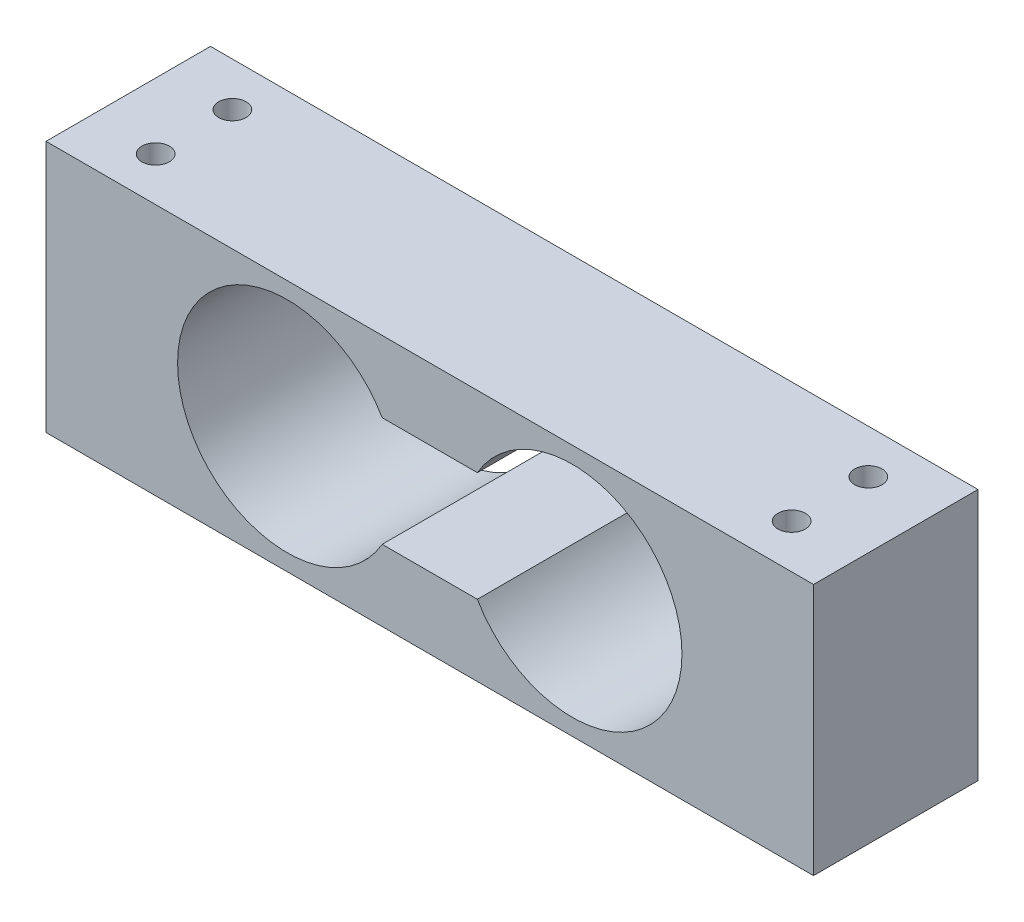
ISO-10303-21;
HEADER;
FILE_DESCRIPTION(('STEP AP214'),'2;1');
FILE_NAME('part.step','',(''),(''),'','','');
FILE_SCHEMA(('AUTOMOTIVE_DESIGN { 1 0 10303 214 1 1 1 1 }'));
ENDSEC;
DATA;
#1=APPLICATION_CONTEXT('core data for automotive mechanical design processes');
#2=APPLICATION_PROTOCOL_DEFINITION('international standard','automotive_design',2000,#1);
#3=PRODUCT_CONTEXT('',#1,'mechanical');
#4=PRODUCT('Part','Part','',(#3));
#5=PRODUCT_RELATED_PRODUCT_CATEGORY('part','',(#4));
#6=PRODUCT_DEFINITION_FORMATION('','',#4);
#7=PRODUCT_DEFINITION_CONTEXT('part definition',#1,'design');
#8=PRODUCT_DEFINITION('design','',#6,#7);
#9=PRODUCT_DEFINITION_SHAPE('','',#8);
#10=(LENGTH_UNIT() NAMED_UNIT(*) SI_UNIT(.MILLI.,.METRE.));
#11=(NAMED_UNIT(*) PLANE_ANGLE_UNIT() SI_UNIT($,.RADIAN.));
#12=(NAMED_UNIT(*) SI_UNIT($,.STERADIAN.) SOLID_ANGLE_UNIT());
#13=UNCERTAINTY_MEASURE_WITH_UNIT(LENGTH_MEASURE(1.E-05),#10,'distance_accuracy_value','');
#14=(GEOMETRIC_REPRESENTATION_CONTEXT(3) GLOBAL_UNCERTAINTY_ASSIGNED_CONTEXT((#13)) GLOBAL_UNIT_ASSIGNED_CONTEXT((#10,
#11,#12)) REPRESENTATION_CONTEXT('',''));
#15=CARTESIAN_POINT('',(0.,0.,0.));
#16=DIRECTION('',(0.,0.,1.));
#17=DIRECTION('',(1.,0.,0.));
#18=AXIS2_PLACEMENT_3D('',#15,#16,#17);
#19=CARTESIAN_POINT('',(0.,23.,7.5));
#20=DIRECTION('',(0.,0.,1.));
#21=DIRECTION('',(1.,0.,0.));
#22=AXIS2_PLACEMENT_3D('',#19,#20,#21);
#23=PLANE('',#22);
#24=DIRECTION('',(0.,1.,0.));
#25=VECTOR('',#24,1.);
#26=CARTESIAN_POINT('',(0.,0.,7.5));
#27=LINE('',#26,#25);
#28=CARTESIAN_POINT('',(0.,0.,7.5));
#29=VERTEX_POINT('',#28);
#30=CARTESIAN_POINT('',(0.,23.,7.5));
#31=VERTEX_POINT('',#30);
#32=EDGE_CURVE('E140',#29,#31,#27,.T.);
#33=ORIENTED_EDGE('',*,*,#32,.T.);
#34=DIRECTION('',(-1.,0.,0.));
#35=VECTOR('',#34,1.);
#36=CARTESIAN_POINT('',(0.,23.,7.5));
#37=LINE('',#36,#35);
#38=CARTESIAN_POINT('',(-70.,23.,7.5));
#39=VERTEX_POINT('',#38);
#40=EDGE_CURVE('E143',#31,#39,#37,.T.);
#41=ORIENTED_EDGE('',*,*,#40,.T.);
#42=DIRECTION('',(0.,-1.,0.));
#43=VECTOR('',#42,1.);
#44=CARTESIAN_POINT('',(-70.,0.,7.5));
#45=LINE('',#44,#43);
#46=CARTESIAN_POINT('',(-70.,0.,7.5));
#47=VERTEX_POINT('',#46);
#48=EDGE_CURVE('E145',#39,#47,#45,.T.);
#49=ORIENTED_EDGE('',*,*,#48,.T.);
#50=DIRECTION('',(1.,0.,0.));
#51=VECTOR('',#50,1.);
#52=CARTESIAN_POINT('',(0.,0.,7.5));
#53=LINE('',#52,#51);
#54=EDGE_CURVE('E147',#47,#29,#53,.T.);
#55=ORIENTED_EDGE('',*,*,#54,.T.);
#56=EDGE_LOOP('',(#33,#41,#49,#55));
#57=FACE_BOUND('',#56,.T.);
#58=DIRECTION('',(1.,0.,0.));
#59=VECTOR('',#58,1.);
#60=CARTESIAN_POINT('',(-39.3397459621556,6.5,7.5));
#61=LINE('',#60,#59);
#62=CARTESIAN_POINT('',(-39.3397459621556,6.5,7.5));
#63=VERTEX_POINT('',#62);
#64=CARTESIAN_POINT('',(-30.6602540378444,6.5,7.5));
#65=VERTEX_POINT('',#64);
#66=EDGE_CURVE('E122',#63,#65,#61,.T.);
#67=ORIENTED_EDGE('',*,*,#66,.F.);
#68=CARTESIAN_POINT('',(-48.,11.5,7.5));
#69=DIRECTION('',(0.,0.,1.));
#70=DIRECTION('',(1.,0.,0.));
#71=AXIS2_PLACEMENT_3D('',#68,#69,#70);
#72=CIRCLE('',#71,10.);
#73=CARTESIAN_POINT('',(-39.3397459621556,16.5,7.5));
#74=VERTEX_POINT('',#73);
#75=EDGE_CURVE('E106',#74,#63,#72,.T.);
#76=ORIENTED_EDGE('',*,*,#75,.F.);
#77=DIRECTION('',(-1.,0.,0.));
#78=VECTOR('',#77,1.);
#79=CARTESIAN_POINT('',(-39.3397459621556,16.5,7.5));
#80=LINE('',#79,#78);
#81=CARTESIAN_POINT('',(-30.6602540378444,16.5,7.5));
#82=VERTEX_POINT('',#81);
#83=EDGE_CURVE('E126',#82,#74,#80,.T.);
#84=ORIENTED_EDGE('',*,*,#83,.F.);
#85=CARTESIAN_POINT('',(-22.,11.5,7.5));
#86=DIRECTION('',(0.,0.,1.));
#87=DIRECTION('',(1.,0.,0.));
#88=AXIS2_PLACEMENT_3D('',#85,#86,#87);
#89=CIRCLE('',#88,10.);
#90=EDGE_CURVE('E124',#65,#82,#89,.T.);
#91=ORIENTED_EDGE('',*,*,#90,.F.);
#92=EDGE_LOOP('',(#67,#76,#84,#91));
#93=FACE_BOUND('',#92,.T.);
#94=ADVANCED_FACE('F26',(#57,#93),#23,.T.);
#95=CARTESIAN_POINT('',(0.,23.,-7.5));
#96=DIRECTION('',(0.,0.,1.));
#97=DIRECTION('',(1.,0.,0.));
#98=AXIS2_PLACEMENT_3D('',#95,#96,#97);
#99=PLANE('',#98);
#100=DIRECTION('',(0.,1.,0.));
#101=VECTOR('',#100,1.);
#102=CARTESIAN_POINT('',(0.,0.,-7.5));
#103=LINE('',#102,#101);
#104=CARTESIAN_POINT('',(0.,0.,-7.5));
#105=VERTEX_POINT('',#104);
#106=CARTESIAN_POINT('',(0.,23.,-7.5));
#107=VERTEX_POINT('',#106);
#108=EDGE_CURVE('E107',#105,#107,#103,.T.);
#109=ORIENTED_EDGE('',*,*,#108,.F.);
#110=DIRECTION('',(1.,0.,0.));
#111=VECTOR('',#110,1.);
#112=CARTESIAN_POINT('',(0.,0.,-7.5));
#113=LINE('',#112,#111);
#114=CARTESIAN_POINT('',(-70.,0.,-7.5));
#115=VERTEX_POINT('',#114);
#116=EDGE_CURVE('E138',#115,#105,#113,.T.);
#117=ORIENTED_EDGE('',*,*,#116,.F.);
#118=DIRECTION('',(0.,-1.,0.));
#119=VECTOR('',#118,1.);
#120=CARTESIAN_POINT('',(-70.,0.,-7.5));
#121=LINE('',#120,#119);
#122=CARTESIAN_POINT('',(-70.,23.,-7.5));
#123=VERTEX_POINT('',#122);
#124=EDGE_CURVE('E136',#123,#115,#121,.T.);
#125=ORIENTED_EDGE('',*,*,#124,.F.);
#126=DIRECTION('',(-1.,0.,0.));
#127=VECTOR('',#126,1.);
#128=CARTESIAN_POINT('',(0.,23.,-7.5));
#129=LINE('',#128,#127);
#130=EDGE_CURVE('E134',#107,#123,#129,.T.);
#131=ORIENTED_EDGE('',*,*,#130,.F.);
#132=EDGE_LOOP('',(#109,#117,#125,#131));
#133=FACE_BOUND('',#132,.T.);
#134=CARTESIAN_POINT('',(-48.,11.5,-7.5));
#135=DIRECTION('',(0.,0.,1.));
#136=DIRECTION('',(1.,0.,0.));
#137=AXIS2_PLACEMENT_3D('',#134,#135,#136);
#138=CIRCLE('',#137,10.);
#139=CARTESIAN_POINT('',(-39.3397459621556,16.5,-7.5));
#140=VERTEX_POINT('',#139);
#141=CARTESIAN_POINT('',(-39.3397459621556,6.5,-7.5));
#142=VERTEX_POINT('',#141);
#143=EDGE_CURVE('E49',#140,#142,#138,.T.);
#144=ORIENTED_EDGE('',*,*,#143,.T.);
#145=DIRECTION('',(1.,0.,0.));
#146=VECTOR('',#145,1.);
#147=CARTESIAN_POINT('',(-39.3397459621556,6.5,-7.5));
#148=LINE('',#147,#146);
#149=CARTESIAN_POINT('',(-30.6602540378444,6.5,-7.5));
#150=VERTEX_POINT('',#149);
#151=EDGE_CURVE('E93',#142,#150,#148,.T.);
#152=ORIENTED_EDGE('',*,*,#151,.T.);
#153=CARTESIAN_POINT('',(-22.,11.5,-7.5));
#154=DIRECTION('',(0.,0.,1.));
#155=DIRECTION('',(1.,0.,0.));
#156=AXIS2_PLACEMENT_3D('',#153,#154,#155);
#157=CIRCLE('',#156,10.);
#158=CARTESIAN_POINT('',(-30.6602540378444,16.5,-7.5));
#159=VERTEX_POINT('',#158);
#160=EDGE_CURVE('E102',#150,#159,#157,.T.);
#161=ORIENTED_EDGE('',*,*,#160,.T.);
#162=DIRECTION('',(-1.,0.,0.));
#163=VECTOR('',#162,1.);
#164=CARTESIAN_POINT('',(-39.3397459621556,16.5,-7.5));
#165=LINE('',#164,#163);
#166=EDGE_CURVE('E111',#159,#140,#165,.T.);
#167=ORIENTED_EDGE('',*,*,#166,.T.);
#168=EDGE_LOOP('',(#144,#152,#161,#167));
#169=FACE_BOUND('',#168,.T.);
#170=ADVANCED_FACE('F110',(#133,#169),#99,.F.);
#171=CARTESIAN_POINT('',(0.,0.,7.5));
#172=DIRECTION('',(-1.,0.,0.));
#173=DIRECTION('',(0.,0.,1.));
#174=AXIS2_PLACEMENT_3D('',#171,#172,#173);
#175=PLANE('',#174);
#176=ORIENTED_EDGE('',*,*,#108,.T.);
#177=DIRECTION('',(0.,0.,-1.));
#178=VECTOR('',#177,1.);
#179=CARTESIAN_POINT('',(0.,23.,7.5));
#180=LINE('',#179,#178);
#181=EDGE_CURVE('E11',#31,#107,#180,.T.);
#182=ORIENTED_EDGE('',*,*,#181,.F.);
#183=ORIENTED_EDGE('',*,*,#32,.F.);
#184=DIRECTION('',(0.,0.,-1.));
#185=VECTOR('',#184,1.);
#186=CARTESIAN_POINT('',(0.,0.,7.5));
#187=LINE('',#186,#185);
#188=EDGE_CURVE('E149',#29,#105,#187,.T.);
#189=ORIENTED_EDGE('',*,*,#188,.T.);
#190=EDGE_LOOP('',(#176,#182,#183,#189));
#191=FACE_BOUND('',#190,.T.);
#192=ADVANCED_FACE('F28',(#191),#175,.F.);
#193=CARTESIAN_POINT('',(0.,23.,7.5));
#194=DIRECTION('',(0.,-1.,0.));
#195=DIRECTION('',(1.,0.,0.));
#196=AXIS2_PLACEMENT_3D('',#193,#194,#195);
#197=PLANE('',#196);
#198=CARTESIAN_POINT('',(-64.,23.,-3.5));
#199=DIRECTION('',(0.,1.,0.));
#200=DIRECTION('',(0.,0.,1.));
#201=AXIS2_PLACEMENT_3D('',#198,#199,#200);
#202=CIRCLE('',#201,1.25);
#203=CARTESIAN_POINT('',(-64.,23.,-2.25));
#204=VERTEX_POINT('',#203);
#205=EDGE_CURVE('E223',#204,#204,#202,.T.);
#206=ORIENTED_EDGE('',*,*,#205,.F.);
#207=EDGE_LOOP('',(#206));
#208=FACE_BOUND('',#207,.T.);
#209=CARTESIAN_POINT('',(-64.,23.,3.5));
#210=DIRECTION('',(0.,1.,0.));
#211=DIRECTION('',(0.,0.,1.));
#212=AXIS2_PLACEMENT_3D('',#209,#210,#211);
#213=CIRCLE('',#212,1.25);
#214=CARTESIAN_POINT('',(-64.,23.,4.75));
#215=VERTEX_POINT('',#214);
#216=EDGE_CURVE('E219',#215,#215,#213,.T.);
#217=ORIENTED_EDGE('',*,*,#216,.F.);
#218=EDGE_LOOP('',(#217));
#219=FACE_BOUND('',#218,.T.);
#220=CARTESIAN_POINT('',(-6.,23.,-3.5));
#221=DIRECTION('',(0.,1.,0.));
#222=DIRECTION('',(0.,0.,1.));
#223=AXIS2_PLACEMENT_3D('',#220,#221,#222);
#224=CIRCLE('',#223,1.25);
#225=CARTESIAN_POINT('',(-6.,23.,-2.25));
#226=VERTEX_POINT('',#225);
#227=EDGE_CURVE('E214',#226,#226,#224,.T.);
#228=ORIENTED_EDGE('',*,*,#227,.F.);
#229=EDGE_LOOP('',(#228));
#230=FACE_BOUND('',#229,.T.);
#231=CARTESIAN_POINT('',(-6.,23.,3.50000000000001));
#232=DIRECTION('',(0.,1.,0.));
#233=DIRECTION('',(0.,0.,1.));
#234=AXIS2_PLACEMENT_3D('',#231,#232,#233);
#235=CIRCLE('',#234,1.25);
#236=CARTESIAN_POINT('',(-6.,23.,4.75000000000001));
#237=VERTEX_POINT('',#236);
#238=EDGE_CURVE('E112',#237,#237,#235,.T.);
#239=ORIENTED_EDGE('',*,*,#238,.F.);
#240=EDGE_LOOP('',(#239));
#241=FACE_BOUND('',#240,.T.);
#242=ORIENTED_EDGE('',*,*,#130,.T.);
#243=DIRECTION('',(0.,0.,-1.));
#244=VECTOR('',#243,1.);
#245=CARTESIAN_POINT('',(-70.,23.,7.5));
#246=LINE('',#245,#244);
#247=EDGE_CURVE('E34',#39,#123,#246,.T.);
#248=ORIENTED_EDGE('',*,*,#247,.F.);
#249=ORIENTED_EDGE('',*,*,#40,.F.);
#250=ORIENTED_EDGE('',*,*,#181,.T.);
#251=EDGE_LOOP('',(#242,#248,#249,#250));
#252=FACE_BOUND('',#251,.T.);
#253=ADVANCED_FACE('F174',(#208,#219,#230,#241,#252),#197,.F.);
#254=CARTESIAN_POINT('',(-70.,0.,7.5));
#255=DIRECTION('',(1.,0.,0.));
#256=DIRECTION('',(0.,0.,-1.));
#257=AXIS2_PLACEMENT_3D('',#254,#255,#256);
#258=PLANE('',#257);
#259=ORIENTED_EDGE('',*,*,#124,.T.);
#260=DIRECTION('',(0.,0.,-1.));
#261=VECTOR('',#260,1.);
#262=CARTESIAN_POINT('',(-70.,0.,7.5));
#263=LINE('',#262,#261);
#264=EDGE_CURVE('E152',#47,#115,#263,.T.);
#265=ORIENTED_EDGE('',*,*,#264,.F.);
#266=ORIENTED_EDGE('',*,*,#48,.F.);
#267=ORIENTED_EDGE('',*,*,#247,.T.);
#268=EDGE_LOOP('',(#259,#265,#266,#267));
#269=FACE_BOUND('',#268,.T.);
#270=ADVANCED_FACE('F159',(#269),#258,.F.);
#271=CARTESIAN_POINT('',(0.,0.,7.5));
#272=DIRECTION('',(0.,1.,0.));
#273=DIRECTION('',(-1.,0.,0.));
#274=AXIS2_PLACEMENT_3D('',#271,#272,#273);
#275=PLANE('',#274);
#276=CARTESIAN_POINT('',(-64.,0.,-3.5));
#277=DIRECTION('',(0.,1.,0.));
#278=DIRECTION('',(0.,0.,1.));
#279=AXIS2_PLACEMENT_3D('',#276,#277,#278);
#280=CIRCLE('',#279,1.25);
#281=CARTESIAN_POINT('',(-64.,0.,-2.25));
#282=VERTEX_POINT('',#281);
#283=EDGE_CURVE('E202',#282,#282,#280,.T.);
#284=ORIENTED_EDGE('',*,*,#283,.T.);
#285=EDGE_LOOP('',(#284));
#286=FACE_BOUND('',#285,.T.);
#287=CARTESIAN_POINT('',(-64.,0.,3.5));
#288=DIRECTION('',(0.,1.,0.));
#289=DIRECTION('',(0.,0.,1.));
#290=AXIS2_PLACEMENT_3D('',#287,#288,#289);
#291=CIRCLE('',#290,1.25);
#292=CARTESIAN_POINT('',(-64.,0.,4.75));
#293=VERTEX_POINT('',#292);
#294=EDGE_CURVE('E206',#293,#293,#291,.T.);
#295=ORIENTED_EDGE('',*,*,#294,.T.);
#296=EDGE_LOOP('',(#295));
#297=FACE_BOUND('',#296,.T.);
#298=CARTESIAN_POINT('',(-6.,0.,-3.5));
#299=DIRECTION('',(0.,1.,0.));
#300=DIRECTION('',(0.,0.,1.));
#301=AXIS2_PLACEMENT_3D('',#298,#299,#300);
#302=CIRCLE('',#301,1.24999999999999);
#303=CARTESIAN_POINT('',(-6.,0.,-2.25000000000001));
#304=VERTEX_POINT('',#303);
#305=EDGE_CURVE('E210',#304,#304,#302,.T.);
#306=ORIENTED_EDGE('',*,*,#305,.T.);
#307=EDGE_LOOP('',(#306));
#308=FACE_BOUND('',#307,.T.);
#309=CARTESIAN_POINT('',(-6.,0.,3.50000000000001));
#310=DIRECTION('',(0.,1.,0.));
#311=DIRECTION('',(0.,0.,1.));
#312=AXIS2_PLACEMENT_3D('',#309,#310,#311);
#313=CIRCLE('',#312,1.24999999999999);
#314=CARTESIAN_POINT('',(-6.,0.,4.75));
#315=VERTEX_POINT('',#314);
#316=EDGE_CURVE('E115',#315,#315,#313,.T.);
#317=ORIENTED_EDGE('',*,*,#316,.T.);
#318=EDGE_LOOP('',(#317));
#319=FACE_BOUND('',#318,.T.);
#320=ORIENTED_EDGE('',*,*,#116,.T.);
#321=ORIENTED_EDGE('',*,*,#188,.F.);
#322=ORIENTED_EDGE('',*,*,#54,.F.);
#323=ORIENTED_EDGE('',*,*,#264,.T.);
#324=EDGE_LOOP('',(#320,#321,#322,#323));
#325=FACE_BOUND('',#324,.T.);
#326=ADVANCED_FACE('F167',(#286,#297,#308,#319,#325),#275,.F.);
#327=CARTESIAN_POINT('',(-48.,11.5,7.5));
#328=DIRECTION('',(0.,0.,-1.));
#329=DIRECTION('',(-1.,0.,0.));
#330=AXIS2_PLACEMENT_3D('',#327,#328,#329);
#331=CYLINDRICAL_SURFACE('',#330,10.);
#332=ORIENTED_EDGE('',*,*,#143,.F.);
#333=DIRECTION('',(0.,0.,-1.));
#334=VECTOR('',#333,1.);
#335=CARTESIAN_POINT('',(-39.3397459621556,16.5,7.5));
#336=LINE('',#335,#334);
#337=EDGE_CURVE('E128',#74,#140,#336,.T.);
#338=ORIENTED_EDGE('',*,*,#337,.F.);
#339=ORIENTED_EDGE('',*,*,#75,.T.);
#340=DIRECTION('',(0.,0.,-1.));
#341=VECTOR('',#340,1.);
#342=CARTESIAN_POINT('',(-39.3397459621556,6.5,7.5));
#343=LINE('',#342,#341);
#344=EDGE_CURVE('E95',#63,#142,#343,.T.);
#345=ORIENTED_EDGE('',*,*,#344,.T.);
#346=EDGE_LOOP('',(#332,#338,#339,#345));
#347=FACE_BOUND('',#346,.T.);
#348=ADVANCED_FACE('F104',(#347),#331,.F.);
#349=CARTESIAN_POINT('',(-39.3397459621556,6.5,7.5));
#350=DIRECTION('',(0.,1.,0.));
#351=DIRECTION('',(0.,0.,1.));
#352=AXIS2_PLACEMENT_3D('',#349,#350,#351);
#353=PLANE('',#352);
#354=ORIENTED_EDGE('',*,*,#151,.F.);
#355=ORIENTED_EDGE('',*,*,#344,.F.);
#356=ORIENTED_EDGE('',*,*,#66,.T.);
#357=DIRECTION('',(0.,0.,-1.));
#358=VECTOR('',#357,1.);
#359=CARTESIAN_POINT('',(-30.6602540378444,6.5,7.5));
#360=LINE('',#359,#358);
#361=EDGE_CURVE('E98',#65,#150,#360,.T.);
#362=ORIENTED_EDGE('',*,*,#361,.T.);
#363=EDGE_LOOP('',(#354,#355,#356,#362));
#364=FACE_BOUND('',#363,.T.);
#365=ADVANCED_FACE('F94',(#364),#353,.T.);
#366=CARTESIAN_POINT('',(-22.,11.5,7.5));
#367=DIRECTION('',(0.,0.,-1.));
#368=DIRECTION('',(-1.,0.,0.));
#369=AXIS2_PLACEMENT_3D('',#366,#367,#368);
#370=CYLINDRICAL_SURFACE('',#369,10.);
#371=ORIENTED_EDGE('',*,*,#160,.F.);
#372=ORIENTED_EDGE('',*,*,#361,.F.);
#373=ORIENTED_EDGE('',*,*,#90,.T.);
#374=DIRECTION('',(0.,0.,-1.));
#375=VECTOR('',#374,1.);
#376=CARTESIAN_POINT('',(-30.6602540378444,16.5,7.5));
#377=LINE('',#376,#375);
#378=EDGE_CURVE('E41',#82,#159,#377,.T.);
#379=ORIENTED_EDGE('',*,*,#378,.T.);
#380=EDGE_LOOP('',(#371,#372,#373,#379));
#381=FACE_BOUND('',#380,.T.);
#382=ADVANCED_FACE('F246',(#381),#370,.F.);
#383=CARTESIAN_POINT('',(-39.3397459621556,16.5,7.5));
#384=DIRECTION('',(0.,-1.,0.));
#385=DIRECTION('',(0.,0.,-1.));
#386=AXIS2_PLACEMENT_3D('',#383,#384,#385);
#387=PLANE('',#386);
#388=ORIENTED_EDGE('',*,*,#166,.F.);
#389=ORIENTED_EDGE('',*,*,#378,.F.);
#390=ORIENTED_EDGE('',*,*,#83,.T.);
#391=ORIENTED_EDGE('',*,*,#337,.T.);
#392=EDGE_LOOP('',(#388,#389,#390,#391));
#393=FACE_BOUND('',#392,.T.);
#394=ADVANCED_FACE('F244',(#393),#387,.T.);
#395=CARTESIAN_POINT('',(-6.,23.,3.50000000000001));
#396=DIRECTION('',(0.,1.,0.));
#397=DIRECTION('',(0.,0.,1.));
#398=AXIS2_PLACEMENT_3D('',#395,#396,#397);
#399=CYLINDRICAL_SURFACE('',#398,1.25);
#400=ORIENTED_EDGE('',*,*,#316,.F.);
#401=EDGE_LOOP('',(#400));
#402=FACE_BOUND('',#401,.T.);
#403=ORIENTED_EDGE('',*,*,#238,.T.);
#404=EDGE_LOOP('',(#403));
#405=FACE_BOUND('',#404,.T.);
#406=ADVANCED_FACE('F241',(#402,#405),#399,.F.);
#407=CARTESIAN_POINT('',(-6.,23.,-3.5));
#408=DIRECTION('',(0.,1.,0.));
#409=DIRECTION('',(0.,0.,1.));
#410=AXIS2_PLACEMENT_3D('',#407,#408,#409);
#411=CYLINDRICAL_SURFACE('',#410,1.25);
#412=ORIENTED_EDGE('',*,*,#305,.F.);
#413=EDGE_LOOP('',(#412));
#414=FACE_BOUND('',#413,.T.);
#415=ORIENTED_EDGE('',*,*,#227,.T.);
#416=EDGE_LOOP('',(#415));
#417=FACE_BOUND('',#416,.T.);
#418=ADVANCED_FACE('F235',(#414,#417),#411,.F.);
#419=CARTESIAN_POINT('',(-64.,23.,3.5));
#420=DIRECTION('',(0.,1.,0.));
#421=DIRECTION('',(0.,0.,1.));
#422=AXIS2_PLACEMENT_3D('',#419,#420,#421);
#423=CYLINDRICAL_SURFACE('',#422,1.25);
#424=ORIENTED_EDGE('',*,*,#294,.F.);
#425=EDGE_LOOP('',(#424));
#426=FACE_BOUND('',#425,.T.);
#427=ORIENTED_EDGE('',*,*,#216,.T.);
#428=EDGE_LOOP('',(#427));
#429=FACE_BOUND('',#428,.T.);
#430=ADVANCED_FACE('F229',(#426,#429),#423,.F.);
#431=CARTESIAN_POINT('',(-64.,23.,-3.5));
#432=DIRECTION('',(0.,1.,0.));
#433=DIRECTION('',(0.,0.,1.));
#434=AXIS2_PLACEMENT_3D('',#431,#432,#433);
#435=CYLINDRICAL_SURFACE('',#434,1.25);
#436=ORIENTED_EDGE('',*,*,#283,.F.);
#437=EDGE_LOOP('',(#436));
#438=FACE_BOUND('',#437,.T.);
#439=ORIENTED_EDGE('',*,*,#205,.T.);
#440=EDGE_LOOP('',(#439));
#441=FACE_BOUND('',#440,.T.);
#442=ADVANCED_FACE('F227',(#438,#441),#435,.F.);
#443=CLOSED_SHELL('',(#94,#170,#192,#253,#270,#326,#348,#365,#382,#394,#406,#418,#430,#442));
#444=MANIFOLD_SOLID_BREP('B2',#443);
#445=ADVANCED_BREP_SHAPE_REPRESENTATION('',(#18,#444),#14);
#446=SHAPE_DEFINITION_REPRESENTATION(#9,#445);
ENDSEC;
END-ISO-10303-21;
